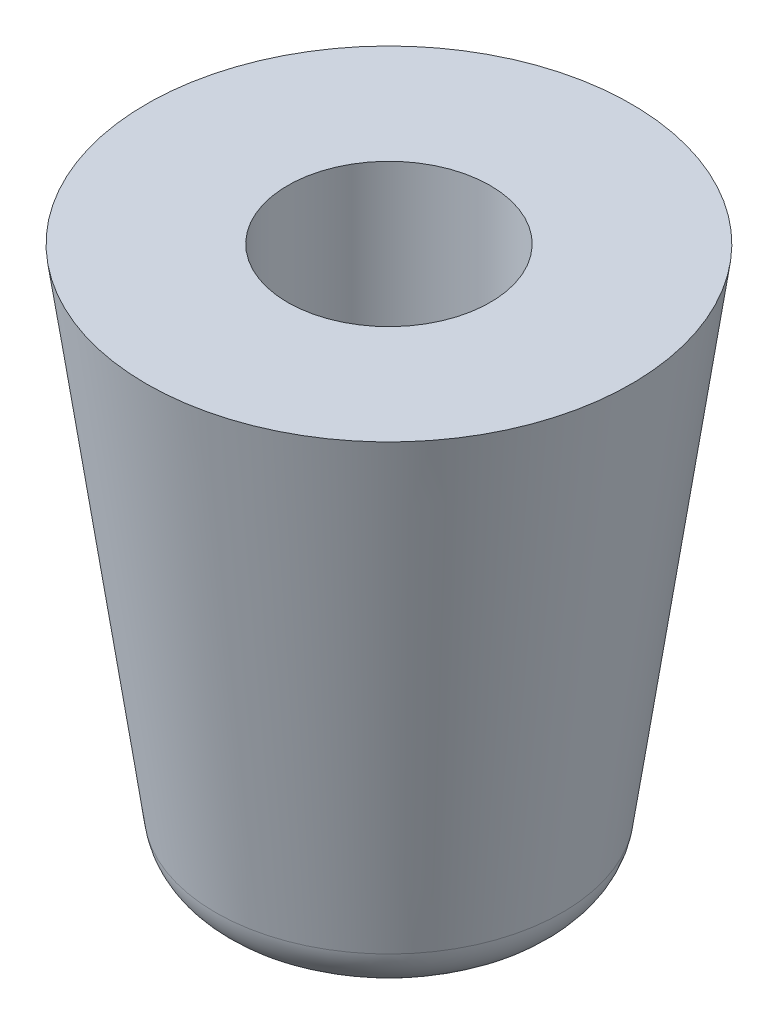
ISO-10303-21;
HEADER;
FILE_DESCRIPTION(('STEP AP214'),'2;1');
FILE_NAME('part.step','',(''),(''),'','','');
FILE_SCHEMA(('AUTOMOTIVE_DESIGN { 1 0 10303 214 1 1 1 1 }'));
ENDSEC;
DATA;
#1=APPLICATION_CONTEXT('core data for automotive mechanical design processes');
#2=APPLICATION_PROTOCOL_DEFINITION('international standard','automotive_design',2000,#1);
#3=PRODUCT_CONTEXT('',#1,'mechanical');
#4=PRODUCT('Part','Part','',(#3));
#5=PRODUCT_RELATED_PRODUCT_CATEGORY('part','',(#4));
#6=PRODUCT_DEFINITION_FORMATION('','',#4);
#7=PRODUCT_DEFINITION_CONTEXT('part definition',#1,'design');
#8=PRODUCT_DEFINITION('design','',#6,#7);
#9=PRODUCT_DEFINITION_SHAPE('','',#8);
#10=(LENGTH_UNIT() NAMED_UNIT(*) SI_UNIT(.MILLI.,.METRE.));
#11=(NAMED_UNIT(*) PLANE_ANGLE_UNIT() SI_UNIT($,.RADIAN.));
#12=(NAMED_UNIT(*) SI_UNIT($,.STERADIAN.) SOLID_ANGLE_UNIT());
#13=UNCERTAINTY_MEASURE_WITH_UNIT(LENGTH_MEASURE(1.E-05),#10,'distance_accuracy_value','');
#14=(GEOMETRIC_REPRESENTATION_CONTEXT(3) GLOBAL_UNCERTAINTY_ASSIGNED_CONTEXT((#13)) GLOBAL_UNIT_ASSIGNED_CONTEXT((#10,
#11,#12)) REPRESENTATION_CONTEXT('',''));
#15=CARTESIAN_POINT('',(0.,0.,0.));
#16=DIRECTION('',(0.,0.,1.));
#17=DIRECTION('',(1.,0.,0.));
#18=AXIS2_PLACEMENT_3D('',#15,#16,#17);
#19=CARTESIAN_POINT('',(0.,0.,0.));
#20=DIRECTION('',(0.,1.,0.));
#21=DIRECTION('',(0.,0.,1.));
#22=AXIS2_PLACEMENT_3D('',#19,#20,#21);
#23=CONICAL_SURFACE('',#22,5.715,0.139626340159546);
#24=CARTESIAN_POINT('',(0.,-11.6067498382193,0.));
#25=DIRECTION('',(0.,1.,0.));
#26=DIRECTION('',(0.,0.,1.));
#27=AXIS2_PLACEMENT_3D('',#24,#25,#26);
#28=CIRCLE('',#27,4.08377768955481);
#29=CARTESIAN_POINT('',(0.,-11.6067498382193,4.08377768955481));
#30=VERTEX_POINT('',#29);
#31=EDGE_CURVE('E38',#30,#30,#28,.T.);
#32=ORIENTED_EDGE('',*,*,#31,.T.);
#33=EDGE_LOOP('',(#32));
#34=FACE_BOUND('',#33,.T.);
#35=CARTESIAN_POINT('',(0.,0.,0.));
#36=DIRECTION('',(0.,1.,0.));
#37=DIRECTION('',(0.,0.,1.));
#38=AXIS2_PLACEMENT_3D('',#35,#36,#37);
#39=CIRCLE('',#38,5.715);
#40=CARTESIAN_POINT('',(0.,0.,5.715));
#41=VERTEX_POINT('',#40);
#42=EDGE_CURVE('E42',#41,#41,#39,.T.);
#43=ORIENTED_EDGE('',*,*,#42,.F.);
#44=EDGE_LOOP('',(#43));
#45=FACE_BOUND('',#44,.T.);
#46=ADVANCED_FACE('F31',(#34,#45),#23,.T.);
#47=CARTESIAN_POINT('',(0.,-12.7,0.));
#48=DIRECTION('',(0.,1.,0.));
#49=DIRECTION('',(0.,0.,1.));
#50=AXIS2_PLACEMENT_3D('',#47,#48,#49);
#51=PLANE('',#50);
#52=CARTESIAN_POINT('',(0.,-12.7,0.));
#53=DIRECTION('',(0.,1.,0.));
#54=DIRECTION('',(0.,0.,1.));
#55=AXIS2_PLACEMENT_3D('',#52,#53,#54);
#56=CIRCLE('',#55,2.82613724225302);
#57=CARTESIAN_POINT('',(0.,-12.7,2.82613724225302));
#58=VERTEX_POINT('',#57);
#59=EDGE_CURVE('E10',#58,#58,#56,.F.);
#60=ORIENTED_EDGE('',*,*,#59,.T.);
#61=EDGE_LOOP('',(#60));
#62=FACE_BOUND('',#61,.T.);
#63=ADVANCED_FACE('F66',(#62),#51,.F.);
#64=CARTESIAN_POINT('',(0.,0.,0.));
#65=DIRECTION('',(0.,1.,0.));
#66=DIRECTION('',(0.,0.,1.));
#67=AXIS2_PLACEMENT_3D('',#64,#65,#66);
#68=PLANE('',#67);
#69=CARTESIAN_POINT('',(0.,0.,0.));
#70=DIRECTION('',(0.,1.,0.));
#71=DIRECTION('',(0.,0.,1.));
#72=AXIS2_PLACEMENT_3D('',#69,#70,#71);
#73=CIRCLE('',#72,2.3876);
#74=CARTESIAN_POINT('',(0.,0.,2.3876));
#75=VERTEX_POINT('',#74);
#76=EDGE_CURVE('E49',#75,#75,#73,.T.);
#77=ORIENTED_EDGE('',*,*,#76,.F.);
#78=EDGE_LOOP('',(#77));
#79=FACE_BOUND('',#78,.T.);
#80=ORIENTED_EDGE('',*,*,#42,.T.);
#81=EDGE_LOOP('',(#80));
#82=FACE_BOUND('',#81,.T.);
#83=ADVANCED_FACE('F60',(#79,#82),#68,.T.);
#84=CARTESIAN_POINT('',(0.,-10.,0.));
#85=DIRECTION('',(0.,1.,0.));
#86=DIRECTION('',(0.,0.,1.));
#87=AXIS2_PLACEMENT_3D('',#84,#85,#86);
#88=CYLINDRICAL_SURFACE('',#87,2.3876);
#89=CARTESIAN_POINT('',(0.,-10.,0.));
#90=DIRECTION('',(0.,1.,0.));
#91=DIRECTION('',(0.,0.,1.));
#92=AXIS2_PLACEMENT_3D('',#89,#90,#91);
#93=CIRCLE('',#92,2.3876);
#94=CARTESIAN_POINT('',(0.,-10.,2.3876));
#95=VERTEX_POINT('',#94);
#96=EDGE_CURVE('E46',#95,#95,#93,.T.);
#97=ORIENTED_EDGE('',*,*,#96,.F.);
#98=EDGE_LOOP('',(#97));
#99=FACE_BOUND('',#98,.T.);
#100=ORIENTED_EDGE('',*,*,#76,.T.);
#101=EDGE_LOOP('',(#100));
#102=FACE_BOUND('',#101,.T.);
#103=ADVANCED_FACE('F57',(#99,#102),#88,.F.);
#104=CARTESIAN_POINT('',(0.,-10.,0.));
#105=DIRECTION('',(0.,1.,0.));
#106=DIRECTION('',(0.,0.,1.));
#107=AXIS2_PLACEMENT_3D('',#104,#105,#106);
#108=PLANE('',#107);
#109=ORIENTED_EDGE('',*,*,#96,.T.);
#110=EDGE_LOOP('',(#109));
#111=FACE_BOUND('',#110,.T.);
#112=ADVANCED_FACE('F55',(#111),#108,.T.);
#113=CARTESIAN_POINT('',(0.,-11.43,0.));
#114=DIRECTION('',(0.,1.,0.));
#115=DIRECTION('',(0.,0.,1.));
#116=AXIS2_PLACEMENT_3D('',#113,#114,#115);
#117=TOROIDAL_SURFACE('',#116,2.82613724225302,1.27);
#118=ORIENTED_EDGE('',*,*,#59,.F.);
#119=EDGE_LOOP('',(#118));
#120=FACE_BOUND('',#119,.T.);
#121=ORIENTED_EDGE('',*,*,#31,.F.);
#122=EDGE_LOOP('',(#121));
#123=FACE_BOUND('',#122,.T.);
#124=ADVANCED_FACE('F33',(#120,#123),#117,.T.);
#125=CLOSED_SHELL('',(#46,#63,#83,#103,#112,#124));
#126=MANIFOLD_SOLID_BREP('B2',#125);
#127=ADVANCED_BREP_SHAPE_REPRESENTATION('',(#18,#126),#14);
#128=SHAPE_DEFINITION_REPRESENTATION(#9,#127);
ENDSEC;
END-ISO-10303-21;
